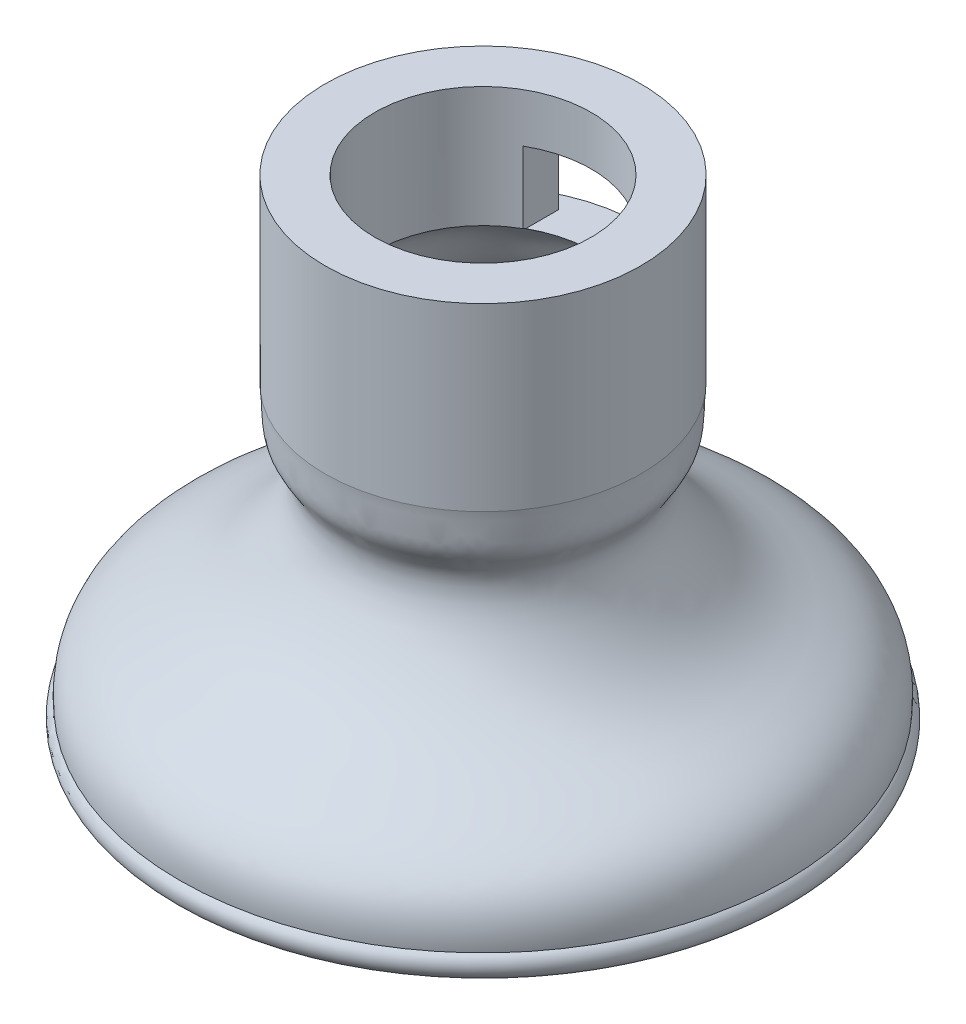
ISO-10303-21;
HEADER;
FILE_DESCRIPTION(('STEP AP214'),'2;1');
FILE_NAME('part.step','',(''),(''),'','','');
FILE_SCHEMA(('AUTOMOTIVE_DESIGN { 1 0 10303 214 1 1 1 1 }'));
ENDSEC;
DATA;
#1=APPLICATION_CONTEXT('core data for automotive mechanical design processes');
#2=APPLICATION_PROTOCOL_DEFINITION('international standard','automotive_design',2000,#1);
#3=PRODUCT_CONTEXT('',#1,'mechanical');
#4=PRODUCT('Part','Part','',(#3));
#5=PRODUCT_RELATED_PRODUCT_CATEGORY('part','',(#4));
#6=PRODUCT_DEFINITION_FORMATION('','',#4);
#7=PRODUCT_DEFINITION_CONTEXT('part definition',#1,'design');
#8=PRODUCT_DEFINITION('design','',#6,#7);
#9=PRODUCT_DEFINITION_SHAPE('','',#8);
#10=(LENGTH_UNIT() NAMED_UNIT(*) SI_UNIT(.MILLI.,.METRE.));
#11=(NAMED_UNIT(*) PLANE_ANGLE_UNIT() SI_UNIT($,.RADIAN.));
#12=(NAMED_UNIT(*) SI_UNIT($,.STERADIAN.) SOLID_ANGLE_UNIT());
#13=UNCERTAINTY_MEASURE_WITH_UNIT(LENGTH_MEASURE(1.E-05),#10,'distance_accuracy_value','');
#14=(GEOMETRIC_REPRESENTATION_CONTEXT(3) GLOBAL_UNCERTAINTY_ASSIGNED_CONTEXT((#13)) GLOBAL_UNIT_ASSIGNED_CONTEXT((#10,
#11,#12)) REPRESENTATION_CONTEXT('',''));
#15=CARTESIAN_POINT('',(0.,0.,0.));
#16=DIRECTION('',(0.,0.,1.));
#17=DIRECTION('',(1.,0.,0.));
#18=AXIS2_PLACEMENT_3D('',#15,#16,#17);
#19=CARTESIAN_POINT('',(0.,44.5173718932186,0.));
#20=DIRECTION('',(0.,1.,0.));
#21=DIRECTION('',(0.,0.,1.));
#22=AXIS2_PLACEMENT_3D('',#19,#20,#21);
#23=CYLINDRICAL_SURFACE('',#22,12.5);
#24=CARTESIAN_POINT('',(0.,55.7803856774506,0.));
#25=DIRECTION('',(0.,1.,0.));
#26=DIRECTION('',(0.,0.,1.));
#27=AXIS2_PLACEMENT_3D('',#24,#25,#26);
#28=CIRCLE('',#27,12.5);
#29=CARTESIAN_POINT('',(0.,55.7803856774506,12.5));
#30=VERTEX_POINT('',#29);
#31=EDGE_CURVE('E204',#30,#30,#28,.T.);
#32=ORIENTED_EDGE('',*,*,#31,.F.);
#33=EDGE_LOOP('',(#32));
#34=FACE_BOUND('',#33,.T.);
#35=CARTESIAN_POINT('',(0.,41.5061281963318,0.));
#36=DIRECTION('',(0.,1.,0.));
#37=DIRECTION('',(0.,0.,1.));
#38=AXIS2_PLACEMENT_3D('',#35,#36,#37);
#39=CIRCLE('',#38,12.5);
#40=CARTESIAN_POINT('',(0.,41.5061281963318,12.5));
#41=VERTEX_POINT('',#40);
#42=EDGE_CURVE('E205',#41,#41,#39,.T.);
#43=ORIENTED_EDGE('',*,*,#42,.T.);
#44=EDGE_LOOP('',(#43));
#45=FACE_BOUND('',#44,.T.);
#46=DIRECTION('',(0.,1.,0.));
#47=VECTOR('',#46,1.);
#48=CARTESIAN_POINT('',(7.15485052197547,44.5173718932186,-10.2497860469469));
#49=LINE('',#48,#47);
#50=CARTESIAN_POINT('',(7.15485052197547,51.8993350708418,-10.2497860469469));
#51=VERTEX_POINT('',#50);
#52=CARTESIAN_POINT('',(7.15485052197547,46.1352918868515,-10.2497860469469));
#53=VERTEX_POINT('',#52);
#54=EDGE_CURVE('E95',#51,#53,#49,.F.);
#55=ORIENTED_EDGE('',*,*,#54,.F.);
#56=CARTESIAN_POINT('',(0.,51.8993350708418,0.));
#57=DIRECTION('',(0.,1.,0.));
#58=DIRECTION('',(0.,0.,1.));
#59=AXIS2_PLACEMENT_3D('',#56,#57,#58);
#60=CIRCLE('',#59,12.5);
#61=CARTESIAN_POINT('',(-7.15485052197547,51.8993350708418,-10.2497860469469));
#62=VERTEX_POINT('',#61);
#63=EDGE_CURVE('E132',#51,#62,#60,.T.);
#64=ORIENTED_EDGE('',*,*,#63,.T.);
#65=DIRECTION('',(0.,1.,0.));
#66=VECTOR('',#65,1.);
#67=CARTESIAN_POINT('',(-7.15485052197547,44.5173718932186,-10.2497860469469));
#68=LINE('',#67,#66);
#69=CARTESIAN_POINT('',(-7.15485052197547,46.1352918868515,-10.2497860469469));
#70=VERTEX_POINT('',#69);
#71=EDGE_CURVE('E97',#70,#62,#68,.T.);
#72=ORIENTED_EDGE('',*,*,#71,.F.);
#73=CARTESIAN_POINT('',(0.,46.1352918868515,0.));
#74=DIRECTION('',(0.,-1.,0.));
#75=DIRECTION('',(0.,0.,-1.));
#76=AXIS2_PLACEMENT_3D('',#73,#74,#75);
#77=CIRCLE('',#76,12.5);
#78=EDGE_CURVE('E43',#70,#53,#77,.T.);
#79=ORIENTED_EDGE('',*,*,#78,.T.);
#80=EDGE_LOOP('',(#55,#64,#72,#79));
#81=FACE_BOUND('',#80,.T.);
#82=ADVANCED_FACE('F33',(#34,#45,#81),#23,.T.);
#83=CARTESIAN_POINT('',(-4.26037974468844,46.1352918868515,-21.));
#84=DIRECTION('',(-1.,0.,0.));
#85=DIRECTION('',(0.,0.,1.));
#86=AXIS2_PLACEMENT_3D('',#83,#84,#85);
#87=PLANE('',#86);
#88=DIRECTION('',(0.,-1.,0.));
#89=VECTOR('',#88,1.);
#90=CARTESIAN_POINT('',(-4.26037974468844,46.1352918868515,-10.2497860469469));
#91=LINE('',#90,#89);
#92=CARTESIAN_POINT('',(-4.26037974468844,51.8993350708418,-10.2497860469469));
#93=VERTEX_POINT('',#92);
#94=CARTESIAN_POINT('',(-4.26037974468844,46.1352918868515,-10.2497860469469));
#95=VERTEX_POINT('',#94);
#96=EDGE_CURVE('E107',#93,#95,#91,.T.);
#97=ORIENTED_EDGE('',*,*,#96,.F.);
#98=DIRECTION('',(0.,0.,1.));
#99=VECTOR('',#98,1.);
#100=CARTESIAN_POINT('',(-4.26037974468844,51.8993350708418,-21.));
#101=LINE('',#100,#99);
#102=CARTESIAN_POINT('',(-4.26037974468844,51.8993350708418,-7.44282760856129));
#103=VERTEX_POINT('',#102);
#104=EDGE_CURVE('E121',#93,#103,#101,.T.);
#105=ORIENTED_EDGE('',*,*,#104,.T.);
#106=DIRECTION('',(0.,1.,0.));
#107=VECTOR('',#106,1.);
#108=CARTESIAN_POINT('',(-4.26037974468844,44.5173718932186,-7.44282760856129));
#109=LINE('',#108,#107);
#110=CARTESIAN_POINT('',(-4.26037974468844,46.2369670314063,-7.44282760856129));
#111=VERTEX_POINT('',#110);
#112=EDGE_CURVE('E99',#111,#103,#109,.T.);
#113=ORIENTED_EDGE('',*,*,#112,.F.);
#114=CARTESIAN_POINT('',(-4.26037974468844,46.1352918868515,-7.64584622277201));
#115=CARTESIAN_POINT('',(-4.26037974468844,46.1532324537293,-7.61250795433293));
#116=CARTESIAN_POINT('',(-4.26037974468844,46.1706756658811,-7.57892060226249));
#117=CARTESIAN_POINT('',(-4.26037974468844,46.2045673807327,-7.51124773085892));
#118=CARTESIAN_POINT('',(-4.26037974468844,46.2210158834325,-7.47716221152578));
#119=CARTESIAN_POINT('',(-4.26037974468844,46.2369670314063,-7.44282760856129));
#120=B_SPLINE_CURVE_WITH_KNOTS('',3,(#114,#115,#116,#117,#118,#119),.UNSPECIFIED.,.F.,.F.,(4,2,
4),(0.,0.113540225574378,0.227080451148758),.UNSPECIFIED.);
#121=CARTESIAN_POINT('',(-4.26037974468844,46.1352918868515,-7.645846222772));
#122=VERTEX_POINT('',#121);
#123=EDGE_CURVE('E150',#122,#111,#120,.T.);
#124=ORIENTED_EDGE('',*,*,#123,.F.);
#125=DIRECTION('',(0.,0.,1.));
#126=VECTOR('',#125,1.);
#127=CARTESIAN_POINT('',(-4.26037974468844,46.1352918868515,-21.));
#128=LINE('',#127,#126);
#129=EDGE_CURVE('E120',#95,#122,#128,.T.);
#130=ORIENTED_EDGE('',*,*,#129,.F.);
#131=EDGE_LOOP('',(#97,#105,#113,#124,#130));
#132=FACE_BOUND('',#131,.T.);
#133=ADVANCED_FACE('F139',(#132),#87,.F.);
#134=CARTESIAN_POINT('',(4.26037974468844,46.1352918868515,-21.));
#135=DIRECTION('',(1.,0.,0.));
#136=DIRECTION('',(0.,0.,-1.));
#137=AXIS2_PLACEMENT_3D('',#134,#135,#136);
#138=PLANE('',#137);
#139=DIRECTION('',(0.,1.,0.));
#140=VECTOR('',#139,1.);
#141=CARTESIAN_POINT('',(4.26037974468844,46.1352918868515,-10.2497860469469));
#142=LINE('',#141,#140);
#143=CARTESIAN_POINT('',(4.26037974468844,46.1352918868515,-10.2497860469469));
#144=VERTEX_POINT('',#143);
#145=CARTESIAN_POINT('',(4.26037974468844,51.8993350708418,-10.2497860469469));
#146=VERTEX_POINT('',#145);
#147=EDGE_CURVE('E11',#144,#146,#142,.T.);
#148=ORIENTED_EDGE('',*,*,#147,.F.);
#149=DIRECTION('',(0.,0.,1.));
#150=VECTOR('',#149,1.);
#151=CARTESIAN_POINT('',(4.26037974468844,46.1352918868515,-21.));
#152=LINE('',#151,#150);
#153=CARTESIAN_POINT('',(4.26037974468844,46.1352918868515,-7.645846222772));
#154=VERTEX_POINT('',#153);
#155=EDGE_CURVE('E112',#144,#154,#152,.T.);
#156=ORIENTED_EDGE('',*,*,#155,.T.);
#157=CARTESIAN_POINT('',(4.26037974468844,46.2369670314063,-7.44282760856129));
#158=CARTESIAN_POINT('',(4.26037974468844,46.2210158834325,-7.4771622115259));
#159=CARTESIAN_POINT('',(4.26037974468844,46.2045673807326,-7.51124773085916));
#160=CARTESIAN_POINT('',(4.26037974468844,46.1706756658809,-7.57892060226297));
#161=CARTESIAN_POINT('',(4.26037974468844,46.153232453729,-7.61250795433352));
#162=CARTESIAN_POINT('',(4.26037974468844,46.1352918868511,-7.64584622277272));
#163=B_SPLINE_CURVE_WITH_KNOTS('',3,(#157,#158,#159,#160,#161,#162),.UNSPECIFIED.,.F.,.F.,(4,2,
4),(0.,0.113540225574784,0.227080451149564),.UNSPECIFIED.);
#164=CARTESIAN_POINT('',(4.26037974468844,46.2369670314063,-7.44282760856129));
#165=VERTEX_POINT('',#164);
#166=EDGE_CURVE('E58',#165,#154,#163,.T.);
#167=ORIENTED_EDGE('',*,*,#166,.F.);
#168=DIRECTION('',(0.,1.,0.));
#169=VECTOR('',#168,1.);
#170=CARTESIAN_POINT('',(4.26037974468844,44.5173718932186,-7.44282760856129));
#171=LINE('',#170,#169);
#172=CARTESIAN_POINT('',(4.26037974468844,51.8993350708418,-7.44282760856129));
#173=VERTEX_POINT('',#172);
#174=EDGE_CURVE('E220',#173,#165,#171,.F.);
#175=ORIENTED_EDGE('',*,*,#174,.F.);
#176=DIRECTION('',(0.,0.,1.));
#177=VECTOR('',#176,1.);
#178=CARTESIAN_POINT('',(4.26037974468844,51.8993350708418,-21.));
#179=LINE('',#178,#177);
#180=EDGE_CURVE('E123',#146,#173,#179,.T.);
#181=ORIENTED_EDGE('',*,*,#180,.F.);
#182=EDGE_LOOP('',(#148,#156,#167,#175,#181));
#183=FACE_BOUND('',#182,.T.);
#184=ADVANCED_FACE('F134',(#183),#138,.F.);
#185=CARTESIAN_POINT('',(8.5759266776083,46.2369670314063,0.));
#186=CARTESIAN_POINT('',(10.3326587454869,45.2958316454355,0.));
#187=CARTESIAN_POINT('',(10.4882281767423,43.2412612936859,0.));
#188=CARTESIAN_POINT('',(11.3082477715756,41.6465797041395,0.));
#189=B_SPLINE_CURVE_WITH_KNOTS('',3,(#185,#186,#187,#188),.UNSPECIFIED.,.F.,.F.,(4,4),(0.,1.),.UNSPECIFIED.);
#190=CARTESIAN_POINT('',(0.,44.5173718932186,0.));
#191=DIRECTION('',(0.,1.,0.));
#192=AXIS1_PLACEMENT('',#190,#191);
#193=SURFACE_OF_REVOLUTION('',#189,#192);
#194=CARTESIAN_POINT('',(0.,41.6465797041395,0.));
#195=DIRECTION('',(0.,1.,0.));
#196=DIRECTION('',(0.,0.,1.));
#197=AXIS2_PLACEMENT_3D('',#194,#195,#196);
#198=CIRCLE('',#197,11.3082477715756);
#199=CARTESIAN_POINT('',(0.,41.6465797041395,11.3082477715756));
#200=VERTEX_POINT('',#199);
#201=EDGE_CURVE('E217',#200,#200,#198,.T.);
#202=ORIENTED_EDGE('',*,*,#201,.F.);
#203=EDGE_LOOP('',(#202));
#204=FACE_BOUND('',#203,.T.);
#205=CARTESIAN_POINT('',(0.,46.1352918868515,0.));
#206=DIRECTION('',(0.,1.,0.));
#207=DIRECTION('',(0.,0.,1.));
#208=AXIS2_PLACEMENT_3D('',#205,#206,#207);
#209=CIRCLE('',#208,8.75270244160217);
#210=EDGE_CURVE('E156',#154,#122,#209,.T.);
#211=ORIENTED_EDGE('',*,*,#210,.T.);
#212=ORIENTED_EDGE('',*,*,#123,.T.);
#213=CARTESIAN_POINT('',(0.,46.2369670314063,0.));
#214=DIRECTION('',(0.,1.,0.));
#215=DIRECTION('',(0.,0.,1.));
#216=AXIS2_PLACEMENT_3D('',#213,#214,#215);
#217=CIRCLE('',#216,8.5759266776083);
#218=EDGE_CURVE('E158',#111,#165,#217,.T.);
#219=ORIENTED_EDGE('',*,*,#218,.T.);
#220=ORIENTED_EDGE('',*,*,#166,.T.);
#221=EDGE_LOOP('',(#211,#212,#219,#220));
#222=FACE_BOUND('',#221,.T.);
#223=ADVANCED_FACE('F35',(#204,#222),#193,.T.);
#224=CARTESIAN_POINT('',(11.3082477715756,41.6465797041395,0.));
#225=CARTESIAN_POINT('',(11.2817602828534,41.4218293671531,0.));
#226=CARTESIAN_POINT('',(11.2412834923781,40.9533107052768,0.));
#227=CARTESIAN_POINT('',(11.2070875631257,40.1531408673558,0.));
#228=CARTESIAN_POINT('',(11.1884431282601,39.325301199345,0.));
#229=CARTESIAN_POINT('',(11.101187914534,38.8009942050367,0.));
#230=CARTESIAN_POINT('',(10.9991616771658,38.5428712480627,0.));
#231=CARTESIAN_POINT('',(10.8465031297344,38.2693612861055,0.));
#232=CARTESIAN_POINT('',(10.6288605273415,37.9423401155879,0.));
#233=CARTESIAN_POINT('',(10.3689355540442,37.5548355560355,0.));
#234=CARTESIAN_POINT('',(10.0922987363018,37.0838244039166,0.));
#235=CARTESIAN_POINT('',(9.78916095319407,36.3300826689672,0.));
#236=CARTESIAN_POINT('',(9.65128308309406,35.3870213665291,0.));
#237=CARTESIAN_POINT('',(9.788883574092,33.9191589581486,0.));
#238=CARTESIAN_POINT('',(10.4315929202945,32.2265294817961,0.));
#239=CARTESIAN_POINT('',(11.5345829677305,30.4324668384174,0.));
#240=CARTESIAN_POINT('',(12.7309022535885,28.9154508266553,0.));
#241=CARTESIAN_POINT('',(14.0631892354958,27.6129447644485,0.));
#242=CARTESIAN_POINT('',(15.5165774005552,26.5117622725223,0.));
#243=CARTESIAN_POINT('',(17.117458175908,25.5757650937635,0.));
#244=CARTESIAN_POINT('',(18.7369814483506,24.783206108922,0.));
#245=CARTESIAN_POINT('',(20.2309565078847,24.009113027473,0.));
#246=CARTESIAN_POINT('',(21.4670115768855,23.1763710469336,0.));
#247=CARTESIAN_POINT('',(22.1863551511599,22.4072463006738,0.));
#248=CARTESIAN_POINT('',(22.5755070657601,21.7084787483834,0.));
#249=CARTESIAN_POINT('',(22.7801089792617,21.1115493557611,0.));
#250=CARTESIAN_POINT('',(22.8700758846008,20.5166766556003,0.));
#251=CARTESIAN_POINT('',(22.8828448696084,19.974221941066,0.));
#252=CARTESIAN_POINT('',(22.8655536921817,19.6632136968197,0.));
#253=CARTESIAN_POINT('',(22.8518360493877,19.5132727877034,0.));
#254=B_SPLINE_CURVE_WITH_KNOTS('',3,(#224,#225,#226,#227,#228,#229,#230,#231,#232,#233,#234,
#235,#236,#237,#238,#239,#240,#241,#242,#243,#244,#245,#246,#247,#248,#249,#250,#251,#252,#253),
.UNSPECIFIED.,.F.,.F.,(4,1,1,1,1,1,1,1,1,1,1,1,1,1,1,1,1,1,1,1,1,1,1,1,1,1,1,4),(0.,0.015625,
0.03125,0.0625,0.09375,0.109375,0.125,0.140625,0.15625,0.171875,0.1875,0.21875,0.25,0.3125,
0.375,0.4375,0.5,0.5625,0.625,0.6875,0.75,0.8125,0.875,0.90625,0.9375,0.96875,0.984375,1.),.UNSPECIFIED.);
#255=CARTESIAN_POINT('',(0.,44.5173718932186,0.));
#256=DIRECTION('',(0.,1.,0.));
#257=AXIS1_PLACEMENT('',#255,#256);
#258=SURFACE_OF_REVOLUTION('',#254,#257);
#259=CARTESIAN_POINT('',(0.,19.5132727877034,0.));
#260=DIRECTION('',(0.,1.,0.));
#261=DIRECTION('',(0.,0.,1.));
#262=AXIS2_PLACEMENT_3D('',#259,#260,#261);
#263=CIRCLE('',#262,22.8518360493877);
#264=CARTESIAN_POINT('',(0.,19.5132727877034,22.8518360493877));
#265=VERTEX_POINT('',#264);
#266=EDGE_CURVE('E214',#265,#265,#263,.T.);
#267=ORIENTED_EDGE('',*,*,#266,.F.);
#268=EDGE_LOOP('',(#267));
#269=FACE_BOUND('',#268,.T.);
#270=ORIENTED_EDGE('',*,*,#201,.T.);
#271=EDGE_LOOP('',(#270));
#272=FACE_BOUND('',#271,.T.);
#273=ADVANCED_FACE('F177',(#269,#272),#258,.T.);
#274=CARTESIAN_POINT('',(0.,18.536963595308,0.));
#275=DIRECTION('',(0.,1.,0.));
#276=DIRECTION('',(0.,0.,1.));
#277=AXIS2_PLACEMENT_3D('',#274,#275,#276);
#278=TOROIDAL_SURFACE('',#277,23.3650221865415,1.10296856279886);
#279=CARTESIAN_POINT('',(0.,19.4039449733763,0.));
#280=DIRECTION('',(0.,1.,0.));
#281=DIRECTION('',(0.,0.,1.));
#282=AXIS2_PLACEMENT_3D('',#279,#280,#281);
#283=CIRCLE('',#282,24.0468454338757);
#284=CARTESIAN_POINT('',(0.,19.4039449733763,24.0468454338757));
#285=VERTEX_POINT('',#284);
#286=EDGE_CURVE('E208',#285,#285,#283,.T.);
#287=ORIENTED_EDGE('',*,*,#286,.F.);
#288=EDGE_LOOP('',(#287));
#289=FACE_BOUND('',#288,.T.);
#290=ORIENTED_EDGE('',*,*,#266,.T.);
#291=EDGE_LOOP('',(#290));
#292=FACE_BOUND('',#291,.T.);
#293=ADVANCED_FACE('F180',(#289,#292),#278,.T.);
#294=CARTESIAN_POINT('',(24.0468454338757,19.4039449733763,0.));
#295=CARTESIAN_POINT('',(24.224821104138,21.3493108208796,0.));
#296=CARTESIAN_POINT('',(22.7622844499788,24.5328880426114,0.));
#297=CARTESIAN_POINT('',(16.8430584106651,26.6707350004949,0.));
#298=CARTESIAN_POINT('',(12.5006511964527,30.4583315866936,0.));
#299=CARTESIAN_POINT('',(10.0651889226401,35.6456358643566,0.));
#300=CARTESIAN_POINT('',(12.601764106934,38.3051521167971,0.));
#301=CARTESIAN_POINT('',(12.3383893844207,40.1348377469808,0.));
#302=CARTESIAN_POINT('',(12.5,41.5061281963318,0.));
#303=B_SPLINE_CURVE_WITH_KNOTS('',3,(#294,#295,#296,#297,#298,#299,#300,#301,#302),
.UNSPECIFIED.,.F.,.F.,(4,1,1,1,1,1,4),(0.,0.16403790876829,0.396707876856077,0.62712491194168,
0.824960166484308,0.898995296980307,1.),.UNSPECIFIED.);
#304=CARTESIAN_POINT('',(0.,44.5173718932186,0.));
#305=DIRECTION('',(0.,1.,0.));
#306=AXIS1_PLACEMENT('',#304,#305);
#307=SURFACE_OF_REVOLUTION('',#303,#306);
#308=ORIENTED_EDGE('',*,*,#42,.F.);
#309=EDGE_LOOP('',(#308));
#310=FACE_BOUND('',#309,.T.);
#311=ORIENTED_EDGE('',*,*,#286,.T.);
#312=EDGE_LOOP('',(#311));
#313=FACE_BOUND('',#312,.T.);
#314=ADVANCED_FACE('F184',(#310,#313),#307,.T.);
#315=CARTESIAN_POINT('',(8.5759266776083,55.7803856774506,0.));
#316=DIRECTION('',(0.,-1.,0.));
#317=DIRECTION('',(0.,0.,-1.));
#318=AXIS2_PLACEMENT_3D('',#315,#316,#317);
#319=PLANE('',#318);
#320=CARTESIAN_POINT('',(0.,55.7803856774506,0.));
#321=DIRECTION('',(0.,1.,0.));
#322=DIRECTION('',(0.,0.,1.));
#323=AXIS2_PLACEMENT_3D('',#320,#321,#322);
#324=CIRCLE('',#323,8.5759266776083);
#325=CARTESIAN_POINT('',(0.,55.7803856774506,8.5759266776083));
#326=VERTEX_POINT('',#325);
#327=EDGE_CURVE('E201',#326,#326,#324,.T.);
#328=ORIENTED_EDGE('',*,*,#327,.F.);
#329=EDGE_LOOP('',(#328));
#330=FACE_BOUND('',#329,.T.);
#331=ORIENTED_EDGE('',*,*,#31,.T.);
#332=EDGE_LOOP('',(#331));
#333=FACE_BOUND('',#332,.T.);
#334=ADVANCED_FACE('F188',(#330,#333),#319,.F.);
#335=CARTESIAN_POINT('',(0.,44.5173718932186,0.));
#336=DIRECTION('',(0.,1.,0.));
#337=DIRECTION('',(0.,0.,1.));
#338=AXIS2_PLACEMENT_3D('',#335,#336,#337);
#339=CYLINDRICAL_SURFACE('',#338,8.5759266776083);
#340=ORIENTED_EDGE('',*,*,#218,.F.);
#341=ORIENTED_EDGE('',*,*,#112,.T.);
#342=CARTESIAN_POINT('',(0.,51.8993350708418,0.));
#343=DIRECTION('',(0.,1.,0.));
#344=DIRECTION('',(0.,0.,1.));
#345=AXIS2_PLACEMENT_3D('',#342,#343,#344);
#346=CIRCLE('',#345,8.5759266776083);
#347=EDGE_CURVE('E222',#103,#173,#346,.F.);
#348=ORIENTED_EDGE('',*,*,#347,.T.);
#349=ORIENTED_EDGE('',*,*,#174,.T.);
#350=EDGE_LOOP('',(#340,#341,#348,#349));
#351=FACE_BOUND('',#350,.T.);
#352=ORIENTED_EDGE('',*,*,#327,.T.);
#353=EDGE_LOOP('',(#352));
#354=FACE_BOUND('',#353,.T.);
#355=ADVANCED_FACE('F144',(#351,#354),#339,.F.);
#356=CARTESIAN_POINT('',(4.26037974468844,46.1352918868515,-21.));
#357=DIRECTION('',(0.,-1.,0.));
#358=DIRECTION('',(0.,0.,-1.));
#359=AXIS2_PLACEMENT_3D('',#356,#357,#358);
#360=PLANE('',#359);
#361=ORIENTED_EDGE('',*,*,#78,.F.);
#362=DIRECTION('',(-1.,0.,0.));
#363=VECTOR('',#362,1.);
#364=CARTESIAN_POINT('',(21.,46.1352918868515,-10.2497860469469));
#365=LINE('',#364,#363);
#366=EDGE_CURVE('E50',#95,#70,#365,.T.);
#367=ORIENTED_EDGE('',*,*,#366,.F.);
#368=ORIENTED_EDGE('',*,*,#129,.T.);
#369=ORIENTED_EDGE('',*,*,#210,.F.);
#370=ORIENTED_EDGE('',*,*,#155,.F.);
#371=EDGE_CURVE('E103',#53,#144,#365,.T.);
#372=ORIENTED_EDGE('',*,*,#371,.F.);
#373=EDGE_LOOP('',(#361,#367,#368,#369,#370,#372));
#374=FACE_BOUND('',#373,.T.);
#375=ADVANCED_FACE('F110',(#374),#360,.F.);
#376=CARTESIAN_POINT('',(4.26037974468844,51.8993350708418,-21.));
#377=DIRECTION('',(0.,1.,0.));
#378=DIRECTION('',(0.,0.,1.));
#379=AXIS2_PLACEMENT_3D('',#376,#377,#378);
#380=PLANE('',#379);
#381=ORIENTED_EDGE('',*,*,#63,.F.);
#382=DIRECTION('',(-1.,0.,0.));
#383=VECTOR('',#382,1.);
#384=CARTESIAN_POINT('',(21.,51.8993350708418,-10.2497860469469));
#385=LINE('',#384,#383);
#386=EDGE_CURVE('E106',#51,#146,#385,.T.);
#387=ORIENTED_EDGE('',*,*,#386,.T.);
#388=ORIENTED_EDGE('',*,*,#180,.T.);
#389=ORIENTED_EDGE('',*,*,#347,.F.);
#390=ORIENTED_EDGE('',*,*,#104,.F.);
#391=EDGE_CURVE('E113',#93,#62,#385,.T.);
#392=ORIENTED_EDGE('',*,*,#391,.T.);
#393=EDGE_LOOP('',(#381,#387,#388,#389,#390,#392));
#394=FACE_BOUND('',#393,.T.);
#395=ADVANCED_FACE('F140',(#394),#380,.F.);
#396=CARTESIAN_POINT('',(21.,51.8993350708418,-10.2497860469469));
#397=DIRECTION('',(0.,0.,-1.));
#398=DIRECTION('',(-1.,0.,0.));
#399=AXIS2_PLACEMENT_3D('',#396,#397,#398);
#400=PLANE('',#399);
#401=ORIENTED_EDGE('',*,*,#54,.T.);
#402=ORIENTED_EDGE('',*,*,#371,.T.);
#403=ORIENTED_EDGE('',*,*,#147,.T.);
#404=ORIENTED_EDGE('',*,*,#386,.F.);
#405=EDGE_LOOP('',(#401,#402,#403,#404));
#406=FACE_BOUND('',#405,.T.);
#407=ADVANCED_FACE('F102',(#406),#400,.T.);
#408=ORIENTED_EDGE('',*,*,#71,.T.);
#409=ORIENTED_EDGE('',*,*,#391,.F.);
#410=ORIENTED_EDGE('',*,*,#96,.T.);
#411=ORIENTED_EDGE('',*,*,#366,.T.);
#412=EDGE_LOOP('',(#408,#409,#410,#411));
#413=FACE_BOUND('',#412,.T.);
#414=ADVANCED_FACE('F238',(#413),#400,.T.);
#415=CLOSED_SHELL('',(#82,#133,#184,#223,#273,#293,#314,#334,#355,#375,#395,#407,#414));
#416=MANIFOLD_SOLID_BREP('B2',#415);
#417=ADVANCED_BREP_SHAPE_REPRESENTATION('',(#18,#416),#14);
#418=SHAPE_DEFINITION_REPRESENTATION(#9,#417);
ENDSEC;
END-ISO-10303-21;
